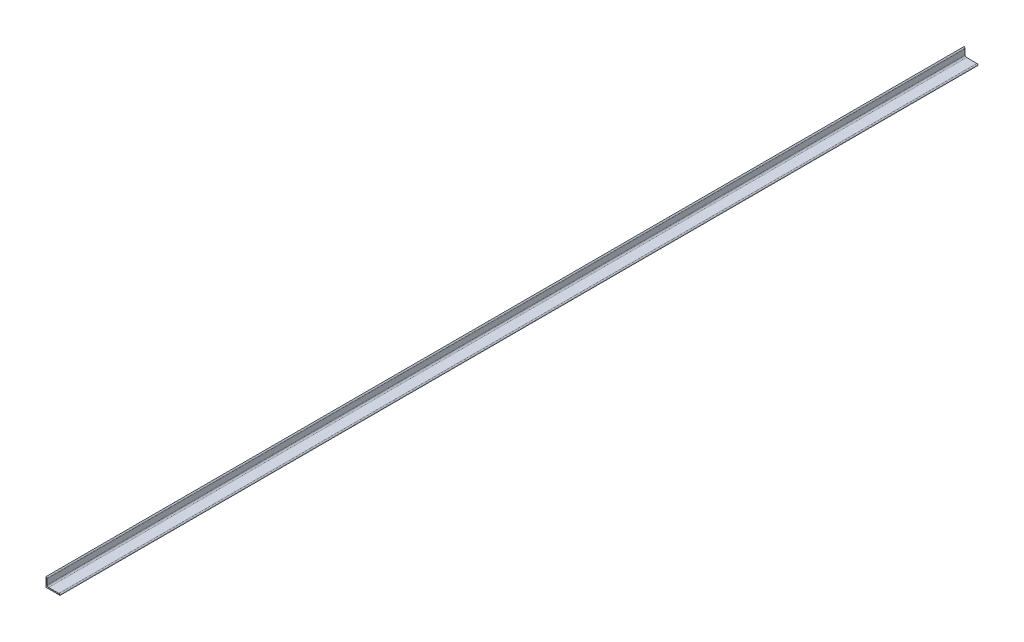
ISO-10303-21;
HEADER;
FILE_DESCRIPTION(('STEP AP214'),'2;1');
FILE_NAME('part.step','',(''),(''),'','','');
FILE_SCHEMA(('AUTOMOTIVE_DESIGN { 1 0 10303 214 1 1 1 1 }'));
ENDSEC;
DATA;
#1=APPLICATION_CONTEXT('core data for automotive mechanical design processes');
#2=APPLICATION_PROTOCOL_DEFINITION('international standard','automotive_design',2000,#1);
#3=PRODUCT_CONTEXT('',#1,'mechanical');
#4=PRODUCT('Part','Part','',(#3));
#5=PRODUCT_RELATED_PRODUCT_CATEGORY('part','',(#4));
#6=PRODUCT_DEFINITION_FORMATION('','',#4);
#7=PRODUCT_DEFINITION_CONTEXT('part definition',#1,'design');
#8=PRODUCT_DEFINITION('design','',#6,#7);
#9=PRODUCT_DEFINITION_SHAPE('','',#8);
#10=(LENGTH_UNIT() NAMED_UNIT(*) SI_UNIT(.MILLI.,.METRE.));
#11=(NAMED_UNIT(*) PLANE_ANGLE_UNIT() SI_UNIT($,.RADIAN.));
#12=(NAMED_UNIT(*) SI_UNIT($,.STERADIAN.) SOLID_ANGLE_UNIT());
#13=UNCERTAINTY_MEASURE_WITH_UNIT(LENGTH_MEASURE(1.E-05),#10,'distance_accuracy_value','');
#14=(GEOMETRIC_REPRESENTATION_CONTEXT(3) GLOBAL_UNCERTAINTY_ASSIGNED_CONTEXT((#13)) GLOBAL_UNIT_ASSIGNED_CONTEXT((#10,
#11,#12)) REPRESENTATION_CONTEXT('',''));
#15=CARTESIAN_POINT('',(0.,0.,0.));
#16=DIRECTION('',(0.,0.,1.));
#17=DIRECTION('',(1.,0.,0.));
#18=AXIS2_PLACEMENT_3D('',#15,#16,#17);
#19=CARTESIAN_POINT('',(0.,50.8,-5000.));
#20=DIRECTION('',(1.,0.,0.));
#21=DIRECTION('',(0.,0.,-1.));
#22=AXIS2_PLACEMENT_3D('',#19,#20,#21);
#23=PLANE('',#22);
#24=DIRECTION('',(0.,1.,0.));
#25=VECTOR('',#24,1.);
#26=CARTESIAN_POINT('',(0.,50.8,0.));
#27=LINE('',#26,#25);
#28=CARTESIAN_POINT('',(0.,0.,0.));
#29=VERTEX_POINT('',#28);
#30=CARTESIAN_POINT('',(0.,50.8,0.));
#31=VERTEX_POINT('',#30);
#32=EDGE_CURVE('E169',#29,#31,#27,.T.);
#33=ORIENTED_EDGE('',*,*,#32,.T.);
#34=DIRECTION('',(0.,0.,1.));
#35=VECTOR('',#34,1.);
#36=CARTESIAN_POINT('',(0.,50.8,-5000.));
#37=LINE('',#36,#35);
#38=CARTESIAN_POINT('',(0.,50.8,-5000.));
#39=VERTEX_POINT('',#38);
#40=EDGE_CURVE('E13',#39,#31,#37,.T.);
#41=ORIENTED_EDGE('',*,*,#40,.F.);
#42=DIRECTION('',(0.,1.,0.));
#43=VECTOR('',#42,1.);
#44=CARTESIAN_POINT('',(0.,50.8,-5000.));
#45=LINE('',#44,#43);
#46=CARTESIAN_POINT('',(0.,0.,-5000.));
#47=VERTEX_POINT('',#46);
#48=EDGE_CURVE('E185',#47,#39,#45,.T.);
#49=ORIENTED_EDGE('',*,*,#48,.F.);
#50=DIRECTION('',(0.,0.,1.));
#51=VECTOR('',#50,1.);
#52=CARTESIAN_POINT('',(0.,0.,-5000.));
#53=LINE('',#52,#51);
#54=EDGE_CURVE('E165',#47,#29,#53,.T.);
#55=ORIENTED_EDGE('',*,*,#54,.T.);
#56=EDGE_LOOP('',(#33,#41,#49,#55));
#57=FACE_BOUND('',#56,.T.);
#58=ADVANCED_FACE('F67',(#57),#23,.F.);
#59=CARTESIAN_POINT('',(0.00508,50.8,-5000.));
#60=DIRECTION('',(0.,-1.,0.));
#61=DIRECTION('',(0.,0.,-1.));
#62=AXIS2_PLACEMENT_3D('',#59,#60,#61);
#63=PLANE('',#62);
#64=DIRECTION('',(1.,0.,0.));
#65=VECTOR('',#64,1.);
#66=CARTESIAN_POINT('',(0.00508,50.8,0.));
#67=LINE('',#66,#65);
#68=CARTESIAN_POINT('',(0.00508000000000024,50.8,0.));
#69=VERTEX_POINT('',#68);
#70=EDGE_CURVE('E172',#31,#69,#67,.T.);
#71=ORIENTED_EDGE('',*,*,#70,.T.);
#72=DIRECTION('',(0.,0.,1.));
#73=VECTOR('',#72,1.);
#74=CARTESIAN_POINT('',(0.00508000000000024,50.8,-5000.));
#75=LINE('',#74,#73);
#76=CARTESIAN_POINT('',(0.00508000000000024,50.8,-5000.));
#77=VERTEX_POINT('',#76);
#78=EDGE_CURVE('E75',#77,#69,#75,.T.);
#79=ORIENTED_EDGE('',*,*,#78,.F.);
#80=DIRECTION('',(1.,0.,0.));
#81=VECTOR('',#80,1.);
#82=CARTESIAN_POINT('',(0.00508,50.8,-5000.));
#83=LINE('',#82,#81);
#84=EDGE_CURVE('E129',#39,#77,#83,.T.);
#85=ORIENTED_EDGE('',*,*,#84,.F.);
#86=ORIENTED_EDGE('',*,*,#40,.T.);
#87=EDGE_LOOP('',(#71,#79,#85,#86));
#88=FACE_BOUND('',#87,.T.);
#89=ADVANCED_FACE('F228',(#88),#63,.F.);
#90=CARTESIAN_POINT('',(0.00507999999999922,44.45508,-5000.));
#91=DIRECTION('',(0.,0.,1.));
#92=DIRECTION('',(1.,0.,0.));
#93=AXIS2_PLACEMENT_3D('',#90,#91,#92);
#94=CYLINDRICAL_SURFACE('',#93,6.34492);
#95=CARTESIAN_POINT('',(0.00507999999999922,44.45508,0.));
#96=DIRECTION('',(0.,0.,-1.));
#97=DIRECTION('',(-1.,0.,0.));
#98=AXIS2_PLACEMENT_3D('',#95,#96,#97);
#99=CIRCLE('',#98,6.34492);
#100=CARTESIAN_POINT('',(6.34999999999999,44.45508,0.));
#101=VERTEX_POINT('',#100);
#102=EDGE_CURVE('E174',#69,#101,#99,.T.);
#103=ORIENTED_EDGE('',*,*,#102,.T.);
#104=DIRECTION('',(0.,0.,1.));
#105=VECTOR('',#104,1.);
#106=CARTESIAN_POINT('',(6.34999999999999,44.45508,-5000.));
#107=LINE('',#106,#105);
#108=CARTESIAN_POINT('',(6.34999999999999,44.45508,-5000.));
#109=VERTEX_POINT('',#108);
#110=EDGE_CURVE('E195',#109,#101,#107,.T.);
#111=ORIENTED_EDGE('',*,*,#110,.F.);
#112=CARTESIAN_POINT('',(0.00507999999999922,44.45508,-5000.));
#113=DIRECTION('',(0.,0.,-1.));
#114=DIRECTION('',(-1.,0.,0.));
#115=AXIS2_PLACEMENT_3D('',#112,#113,#114);
#116=CIRCLE('',#115,6.34492);
#117=EDGE_CURVE('E203',#77,#109,#116,.T.);
#118=ORIENTED_EDGE('',*,*,#117,.F.);
#119=ORIENTED_EDGE('',*,*,#78,.T.);
#120=EDGE_LOOP('',(#103,#111,#118,#119));
#121=FACE_BOUND('',#120,.T.);
#122=ADVANCED_FACE('F201',(#121),#94,.T.);
#123=CARTESIAN_POINT('',(6.34999999999999,14.2875,-5000.));
#124=DIRECTION('',(-1.,0.,0.));
#125=DIRECTION('',(0.,0.,1.));
#126=AXIS2_PLACEMENT_3D('',#123,#124,#125);
#127=PLANE('',#126);
#128=DIRECTION('',(0.,-1.,0.));
#129=VECTOR('',#128,1.);
#130=CARTESIAN_POINT('',(6.34999999999999,14.2875,0.));
#131=LINE('',#130,#129);
#132=CARTESIAN_POINT('',(6.34999999999999,14.2875,0.));
#133=VERTEX_POINT('',#132);
#134=EDGE_CURVE('E176',#101,#133,#131,.T.);
#135=ORIENTED_EDGE('',*,*,#134,.T.);
#136=DIRECTION('',(0.,0.,1.));
#137=VECTOR('',#136,1.);
#138=CARTESIAN_POINT('',(6.34999999999999,14.2875,-5000.));
#139=LINE('',#138,#137);
#140=CARTESIAN_POINT('',(6.34999999999999,14.2875,-5000.));
#141=VERTEX_POINT('',#140);
#142=EDGE_CURVE('E192',#141,#133,#139,.T.);
#143=ORIENTED_EDGE('',*,*,#142,.F.);
#144=DIRECTION('',(0.,-1.,0.));
#145=VECTOR('',#144,1.);
#146=CARTESIAN_POINT('',(6.34999999999999,14.2875,-5000.));
#147=LINE('',#146,#145);
#148=EDGE_CURVE('E219',#109,#141,#147,.T.);
#149=ORIENTED_EDGE('',*,*,#148,.F.);
#150=ORIENTED_EDGE('',*,*,#110,.T.);
#151=EDGE_LOOP('',(#135,#143,#149,#150));
#152=FACE_BOUND('',#151,.T.);
#153=ADVANCED_FACE('F212',(#152),#127,.F.);
#154=CARTESIAN_POINT('',(14.2875,14.2875,-5000.));
#155=DIRECTION('',(0.,0.,1.));
#156=DIRECTION('',(1.,0.,0.));
#157=AXIS2_PLACEMENT_3D('',#154,#155,#156);
#158=CYLINDRICAL_SURFACE('',#157,7.9375);
#159=CARTESIAN_POINT('',(14.2875,14.2875,0.));
#160=DIRECTION('',(0.,0.,1.));
#161=DIRECTION('',(1.,0.,0.));
#162=AXIS2_PLACEMENT_3D('',#159,#160,#161);
#163=CIRCLE('',#162,7.9375);
#164=CARTESIAN_POINT('',(14.2875,6.35,0.));
#165=VERTEX_POINT('',#164);
#166=EDGE_CURVE('E178',#133,#165,#163,.T.);
#167=ORIENTED_EDGE('',*,*,#166,.T.);
#168=DIRECTION('',(0.,0.,1.));
#169=VECTOR('',#168,1.);
#170=CARTESIAN_POINT('',(14.2875,6.35,-5000.));
#171=LINE('',#170,#169);
#172=CARTESIAN_POINT('',(14.2875,6.35,-5000.));
#173=VERTEX_POINT('',#172);
#174=EDGE_CURVE('E189',#173,#165,#171,.T.);
#175=ORIENTED_EDGE('',*,*,#174,.F.);
#176=CARTESIAN_POINT('',(14.2875,14.2875,-5000.));
#177=DIRECTION('',(0.,0.,1.));
#178=DIRECTION('',(1.,0.,0.));
#179=AXIS2_PLACEMENT_3D('',#176,#177,#178);
#180=CIRCLE('',#179,7.9375);
#181=EDGE_CURVE('E218',#141,#173,#180,.T.);
#182=ORIENTED_EDGE('',*,*,#181,.F.);
#183=ORIENTED_EDGE('',*,*,#142,.T.);
#184=EDGE_LOOP('',(#167,#175,#182,#183));
#185=FACE_BOUND('',#184,.T.);
#186=ADVANCED_FACE('F216',(#185),#158,.F.);
#187=CARTESIAN_POINT('',(69.85508,6.34999999999999,-5000.));
#188=DIRECTION('',(0.,-1.,0.));
#189=DIRECTION('',(1.,0.,0.));
#190=AXIS2_PLACEMENT_3D('',#187,#188,#189);
#191=PLANE('',#190);
#192=DIRECTION('',(1.,0.,0.));
#193=VECTOR('',#192,1.);
#194=CARTESIAN_POINT('',(69.85508,6.34999999999999,0.));
#195=LINE('',#194,#193);
#196=CARTESIAN_POINT('',(69.85508,6.34999999999999,0.));
#197=VERTEX_POINT('',#196);
#198=EDGE_CURVE('E180',#165,#197,#195,.T.);
#199=ORIENTED_EDGE('',*,*,#198,.T.);
#200=DIRECTION('',(0.,0.,1.));
#201=VECTOR('',#200,1.);
#202=CARTESIAN_POINT('',(69.85508,6.34999999999999,-5000.));
#203=LINE('',#202,#201);
#204=CARTESIAN_POINT('',(69.85508,6.34999999999999,-5000.));
#205=VERTEX_POINT('',#204);
#206=EDGE_CURVE('E160',#205,#197,#203,.T.);
#207=ORIENTED_EDGE('',*,*,#206,.F.);
#208=DIRECTION('',(1.,0.,0.));
#209=VECTOR('',#208,1.);
#210=CARTESIAN_POINT('',(69.85508,6.34999999999999,-5000.));
#211=LINE('',#210,#209);
#212=EDGE_CURVE('E151',#173,#205,#211,.T.);
#213=ORIENTED_EDGE('',*,*,#212,.F.);
#214=ORIENTED_EDGE('',*,*,#174,.T.);
#215=EDGE_LOOP('',(#199,#207,#213,#214));
#216=FACE_BOUND('',#215,.T.);
#217=ADVANCED_FACE('F240',(#216),#191,.F.);
#218=CARTESIAN_POINT('',(69.85508,0.00508000000000039,-5000.));
#219=DIRECTION('',(0.,0.,1.));
#220=DIRECTION('',(1.,0.,0.));
#221=AXIS2_PLACEMENT_3D('',#218,#219,#220);
#222=CYLINDRICAL_SURFACE('',#221,6.34491999999999);
#223=CARTESIAN_POINT('',(69.85508,0.00508000000000039,0.));
#224=DIRECTION('',(0.,0.,-1.));
#225=DIRECTION('',(1.,0.,0.));
#226=AXIS2_PLACEMENT_3D('',#223,#224,#225);
#227=CIRCLE('',#226,6.34491999999999);
#228=CARTESIAN_POINT('',(76.2,0.00508,0.));
#229=VERTEX_POINT('',#228);
#230=EDGE_CURVE('E159',#197,#229,#227,.T.);
#231=ORIENTED_EDGE('',*,*,#230,.T.);
#232=DIRECTION('',(0.,0.,1.));
#233=VECTOR('',#232,1.);
#234=CARTESIAN_POINT('',(76.2,0.00508,-5000.));
#235=LINE('',#234,#233);
#236=CARTESIAN_POINT('',(76.2,0.00508,-5000.));
#237=VERTEX_POINT('',#236);
#238=EDGE_CURVE('E156',#237,#229,#235,.T.);
#239=ORIENTED_EDGE('',*,*,#238,.F.);
#240=CARTESIAN_POINT('',(69.85508,0.00508000000000039,-5000.));
#241=DIRECTION('',(0.,0.,-1.));
#242=DIRECTION('',(1.,0.,0.));
#243=AXIS2_PLACEMENT_3D('',#240,#241,#242);
#244=CIRCLE('',#243,6.34491999999999);
#245=EDGE_CURVE('E145',#205,#237,#244,.T.);
#246=ORIENTED_EDGE('',*,*,#245,.F.);
#247=ORIENTED_EDGE('',*,*,#206,.T.);
#248=EDGE_LOOP('',(#231,#239,#246,#247));
#249=FACE_BOUND('',#248,.T.);
#250=ADVANCED_FACE('F157',(#249),#222,.T.);
#251=CARTESIAN_POINT('',(76.2,0.,-5000.));
#252=DIRECTION('',(-1.,0.,0.));
#253=DIRECTION('',(0.,0.,1.));
#254=AXIS2_PLACEMENT_3D('',#251,#252,#253);
#255=PLANE('',#254);
#256=DIRECTION('',(0.,-1.,0.));
#257=VECTOR('',#256,1.);
#258=CARTESIAN_POINT('',(76.2,0.,0.));
#259=LINE('',#258,#257);
#260=CARTESIAN_POINT('',(76.2,0.,0.));
#261=VERTEX_POINT('',#260);
#262=EDGE_CURVE('E115',#229,#261,#259,.T.);
#263=ORIENTED_EDGE('',*,*,#262,.T.);
#264=DIRECTION('',(0.,0.,1.));
#265=VECTOR('',#264,1.);
#266=CARTESIAN_POINT('',(76.2,0.,-5000.));
#267=LINE('',#266,#265);
#268=CARTESIAN_POINT('',(76.2,0.,-5000.));
#269=VERTEX_POINT('',#268);
#270=EDGE_CURVE('E161',#269,#261,#267,.T.);
#271=ORIENTED_EDGE('',*,*,#270,.F.);
#272=DIRECTION('',(0.,-1.,0.));
#273=VECTOR('',#272,1.);
#274=CARTESIAN_POINT('',(76.2,0.,-5000.));
#275=LINE('',#274,#273);
#276=EDGE_CURVE('E149',#237,#269,#275,.T.);
#277=ORIENTED_EDGE('',*,*,#276,.F.);
#278=ORIENTED_EDGE('',*,*,#238,.T.);
#279=EDGE_LOOP('',(#263,#271,#277,#278));
#280=FACE_BOUND('',#279,.T.);
#281=ADVANCED_FACE('F163',(#280),#255,.F.);
#282=CARTESIAN_POINT('',(0.,0.,-5000.));
#283=DIRECTION('',(0.,1.,0.));
#284=DIRECTION('',(0.,0.,1.));
#285=AXIS2_PLACEMENT_3D('',#282,#283,#284);
#286=PLANE('',#285);
#287=DIRECTION('',(-1.,0.,0.));
#288=VECTOR('',#287,1.);
#289=CARTESIAN_POINT('',(0.,0.,0.));
#290=LINE('',#289,#288);
#291=EDGE_CURVE('E121',#261,#29,#290,.T.);
#292=ORIENTED_EDGE('',*,*,#291,.T.);
#293=ORIENTED_EDGE('',*,*,#54,.F.);
#294=DIRECTION('',(-1.,0.,0.));
#295=VECTOR('',#294,1.);
#296=CARTESIAN_POINT('',(0.,0.,-5000.));
#297=LINE('',#296,#295);
#298=EDGE_CURVE('E83',#269,#47,#297,.T.);
#299=ORIENTED_EDGE('',*,*,#298,.F.);
#300=ORIENTED_EDGE('',*,*,#270,.T.);
#301=EDGE_LOOP('',(#292,#293,#299,#300));
#302=FACE_BOUND('',#301,.T.);
#303=ADVANCED_FACE('F248',(#302),#286,.F.);
#304=CARTESIAN_POINT('',(69.85508,0.00508000000000039,-5000.));
#305=DIRECTION('',(0.,0.,1.));
#306=DIRECTION('',(1.,0.,0.));
#307=AXIS2_PLACEMENT_3D('',#304,#305,#306);
#308=PLANE('',#307);
#309=ORIENTED_EDGE('',*,*,#48,.T.);
#310=ORIENTED_EDGE('',*,*,#84,.T.);
#311=ORIENTED_EDGE('',*,*,#117,.T.);
#312=ORIENTED_EDGE('',*,*,#148,.T.);
#313=ORIENTED_EDGE('',*,*,#181,.T.);
#314=ORIENTED_EDGE('',*,*,#212,.T.);
#315=ORIENTED_EDGE('',*,*,#245,.T.);
#316=ORIENTED_EDGE('',*,*,#276,.T.);
#317=ORIENTED_EDGE('',*,*,#298,.T.);
#318=EDGE_LOOP('',(#309,#310,#311,#312,#313,#314,#315,#316,#317));
#319=FACE_BOUND('',#318,.T.);
#320=ADVANCED_FACE('F147',(#319),#308,.F.);
#321=CARTESIAN_POINT('',(69.85508,0.00508000000000039,0.));
#322=DIRECTION('',(0.,0.,1.));
#323=DIRECTION('',(1.,0.,0.));
#324=AXIS2_PLACEMENT_3D('',#321,#322,#323);
#325=PLANE('',#324);
#326=ORIENTED_EDGE('',*,*,#32,.F.);
#327=ORIENTED_EDGE('',*,*,#291,.F.);
#328=ORIENTED_EDGE('',*,*,#262,.F.);
#329=ORIENTED_EDGE('',*,*,#230,.F.);
#330=ORIENTED_EDGE('',*,*,#198,.F.);
#331=ORIENTED_EDGE('',*,*,#166,.F.);
#332=ORIENTED_EDGE('',*,*,#134,.F.);
#333=ORIENTED_EDGE('',*,*,#102,.F.);
#334=ORIENTED_EDGE('',*,*,#70,.F.);
#335=EDGE_LOOP('',(#326,#327,#328,#329,#330,#331,#332,#333,#334));
#336=FACE_BOUND('',#335,.T.);
#337=ADVANCED_FACE('F207',(#336),#325,.T.);
#338=CLOSED_SHELL('',(#58,#89,#122,#153,#186,#217,#250,#281,#303,#320,#337));
#339=MANIFOLD_SOLID_BREP('B2',#338);
#340=ADVANCED_BREP_SHAPE_REPRESENTATION('',(#18,#339),#14);
#341=SHAPE_DEFINITION_REPRESENTATION(#9,#340);
ENDSEC;
END-ISO-10303-21;
